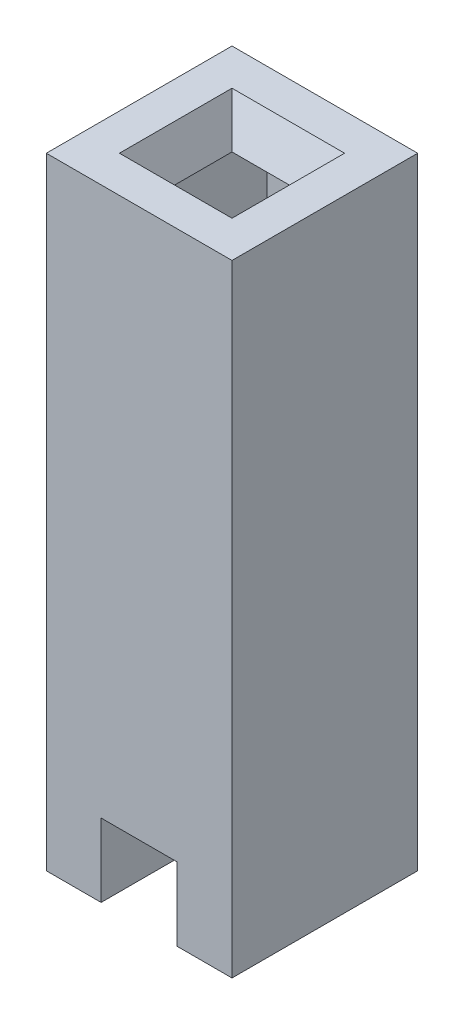
ISO-10303-21;
HEADER;
FILE_DESCRIPTION(('STEP AP214'),'2;1');
FILE_NAME('part.step','',(''),(''),'','','');
FILE_SCHEMA(('AUTOMOTIVE_DESIGN { 1 0 10303 214 1 1 1 1 }'));
ENDSEC;
DATA;
#1=APPLICATION_CONTEXT('core data for automotive mechanical design processes');
#2=APPLICATION_PROTOCOL_DEFINITION('international standard','automotive_design',2000,#1);
#3=PRODUCT_CONTEXT('',#1,'mechanical');
#4=PRODUCT('Part','Part','',(#3));
#5=PRODUCT_RELATED_PRODUCT_CATEGORY('part','',(#4));
#6=PRODUCT_DEFINITION_FORMATION('','',#4);
#7=PRODUCT_DEFINITION_CONTEXT('part definition',#1,'design');
#8=PRODUCT_DEFINITION('design','',#6,#7);
#9=PRODUCT_DEFINITION_SHAPE('','',#8);
#10=(LENGTH_UNIT() NAMED_UNIT(*) SI_UNIT(.MILLI.,.METRE.));
#11=(NAMED_UNIT(*) PLANE_ANGLE_UNIT() SI_UNIT($,.RADIAN.));
#12=(NAMED_UNIT(*) SI_UNIT($,.STERADIAN.) SOLID_ANGLE_UNIT());
#13=UNCERTAINTY_MEASURE_WITH_UNIT(LENGTH_MEASURE(1.E-05),#10,'distance_accuracy_value','');
#14=(GEOMETRIC_REPRESENTATION_CONTEXT(3) GLOBAL_UNCERTAINTY_ASSIGNED_CONTEXT((#13)) GLOBAL_UNIT_ASSIGNED_CONTEXT((#10,
#11,#12)) REPRESENTATION_CONTEXT('',''));
#15=CARTESIAN_POINT('',(0.,0.,0.));
#16=DIRECTION('',(0.,0.,1.));
#17=DIRECTION('',(1.,0.,0.));
#18=AXIS2_PLACEMENT_3D('',#15,#16,#17);
#19=CARTESIAN_POINT('',(-0.75,1.,2.54));
#20=DIRECTION('',(0.,1.,0.));
#21=DIRECTION('',(-1.,0.,0.));
#22=AXIS2_PLACEMENT_3D('',#19,#20,#21);
#23=PLANE('',#22);
#24=DIRECTION('',(0.,0.,-1.));
#25=VECTOR('',#24,1.);
#26=CARTESIAN_POINT('',(-1.79,1.,2.54));
#27=LINE('',#26,#25);
#28=CARTESIAN_POINT('',(-1.79,1.,2.54));
#29=VERTEX_POINT('',#28);
#30=CARTESIAN_POINT('',(-1.79,1.,2.27));
#31=VERTEX_POINT('',#30);
#32=EDGE_CURVE('E275',#29,#31,#27,.T.);
#33=ORIENTED_EDGE('',*,*,#32,.T.);
#34=DIRECTION('',(-1.,0.,0.));
#35=VECTOR('',#34,1.);
#36=CARTESIAN_POINT('',(-1.79,1.,2.27));
#37=LINE('',#36,#35);
#38=CARTESIAN_POINT('',(-0.75,1.,2.27));
#39=VERTEX_POINT('',#38);
#40=EDGE_CURVE('E211',#39,#31,#37,.T.);
#41=ORIENTED_EDGE('',*,*,#40,.F.);
#42=DIRECTION('',(0.,0.,-1.));
#43=VECTOR('',#42,1.);
#44=CARTESIAN_POINT('',(-0.75,1.,2.54));
#45=LINE('',#44,#43);
#46=CARTESIAN_POINT('',(-0.75,1.,2.54));
#47=VERTEX_POINT('',#46);
#48=EDGE_CURVE('E271',#47,#39,#45,.T.);
#49=ORIENTED_EDGE('',*,*,#48,.F.);
#50=DIRECTION('',(1.,0.,0.));
#51=VECTOR('',#50,1.);
#52=CARTESIAN_POINT('',(-0.75,1.,2.54));
#53=LINE('',#52,#51);
#54=EDGE_CURVE('E240',#29,#47,#53,.T.);
#55=ORIENTED_EDGE('',*,*,#54,.F.);
#56=EDGE_LOOP('',(#33,#41,#49,#55));
#57=FACE_BOUND('',#56,.T.);
#58=ADVANCED_FACE('F40',(#57),#23,.F.);
#59=CARTESIAN_POINT('',(0.,0.,2.54));
#60=DIRECTION('',(-1.,0.,0.));
#61=DIRECTION('',(0.,-1.,0.));
#62=AXIS2_PLACEMENT_3D('',#59,#60,#61);
#63=PLANE('',#62);
#64=DIRECTION('',(0.,1.,0.));
#65=VECTOR('',#64,1.);
#66=CARTESIAN_POINT('',(0.,0.,0.));
#67=LINE('',#66,#65);
#68=CARTESIAN_POINT('',(0.,0.,0.));
#69=VERTEX_POINT('',#68);
#70=CARTESIAN_POINT('',(0.,8.5,0.));
#71=VERTEX_POINT('',#70);
#72=EDGE_CURVE('E226',#69,#71,#67,.T.);
#73=ORIENTED_EDGE('',*,*,#72,.T.);
#74=DIRECTION('',(0.,0.,-1.));
#75=VECTOR('',#74,1.);
#76=CARTESIAN_POINT('',(0.,8.5,2.54));
#77=LINE('',#76,#75);
#78=CARTESIAN_POINT('',(0.,8.5,2.54));
#79=VERTEX_POINT('',#78);
#80=EDGE_CURVE('E12',#79,#71,#77,.T.);
#81=ORIENTED_EDGE('',*,*,#80,.F.);
#82=DIRECTION('',(0.,1.,0.));
#83=VECTOR('',#82,1.);
#84=CARTESIAN_POINT('',(0.,0.,2.54));
#85=LINE('',#84,#83);
#86=CARTESIAN_POINT('',(0.,0.,2.54));
#87=VERTEX_POINT('',#86);
#88=EDGE_CURVE('E227',#87,#79,#85,.T.);
#89=ORIENTED_EDGE('',*,*,#88,.F.);
#90=DIRECTION('',(0.,0.,-1.));
#91=VECTOR('',#90,1.);
#92=CARTESIAN_POINT('',(0.,0.,2.54));
#93=LINE('',#92,#91);
#94=EDGE_CURVE('E246',#87,#69,#93,.T.);
#95=ORIENTED_EDGE('',*,*,#94,.T.);
#96=EDGE_LOOP('',(#73,#81,#89,#95));
#97=FACE_BOUND('',#96,.T.);
#98=ADVANCED_FACE('F42',(#97),#63,.F.);
#99=CARTESIAN_POINT('',(0.,8.5,2.54));
#100=DIRECTION('',(0.,-1.,0.));
#101=DIRECTION('',(0.,0.,-1.));
#102=AXIS2_PLACEMENT_3D('',#99,#100,#101);
#103=PLANE('',#102);
#104=DIRECTION('',(-1.,0.,0.));
#105=VECTOR('',#104,1.);
#106=CARTESIAN_POINT('',(-0.5,8.5,0.5));
#107=LINE('',#106,#105);
#108=CARTESIAN_POINT('',(-0.5,8.5,0.5));
#109=VERTEX_POINT('',#108);
#110=CARTESIAN_POINT('',(-2.04,8.5,0.5));
#111=VERTEX_POINT('',#110);
#112=EDGE_CURVE('E180',#109,#111,#107,.T.);
#113=ORIENTED_EDGE('',*,*,#112,.F.);
#114=DIRECTION('',(0.,0.,-1.));
#115=VECTOR('',#114,1.);
#116=CARTESIAN_POINT('',(-0.5,8.5,2.04));
#117=LINE('',#116,#115);
#118=CARTESIAN_POINT('',(-0.5,8.5,2.04));
#119=VERTEX_POINT('',#118);
#120=EDGE_CURVE('E55',#119,#109,#117,.T.);
#121=ORIENTED_EDGE('',*,*,#120,.F.);
#122=DIRECTION('',(1.,0.,0.));
#123=VECTOR('',#122,1.);
#124=CARTESIAN_POINT('',(-2.04,8.5,2.04));
#125=LINE('',#124,#123);
#126=CARTESIAN_POINT('',(-2.04,8.5,2.04));
#127=VERTEX_POINT('',#126);
#128=EDGE_CURVE('E166',#127,#119,#125,.T.);
#129=ORIENTED_EDGE('',*,*,#128,.F.);
#130=DIRECTION('',(0.,0.,1.));
#131=VECTOR('',#130,1.);
#132=CARTESIAN_POINT('',(-2.04,8.5,0.5));
#133=LINE('',#132,#131);
#134=EDGE_CURVE('E175',#111,#127,#133,.T.);
#135=ORIENTED_EDGE('',*,*,#134,.F.);
#136=EDGE_LOOP('',(#113,#121,#129,#135));
#137=FACE_BOUND('',#136,.T.);
#138=DIRECTION('',(-1.,0.,0.));
#139=VECTOR('',#138,1.);
#140=CARTESIAN_POINT('',(0.,8.5,0.));
#141=LINE('',#140,#139);
#142=CARTESIAN_POINT('',(-2.54,8.5,0.));
#143=VERTEX_POINT('',#142);
#144=EDGE_CURVE('E250',#71,#143,#141,.T.);
#145=ORIENTED_EDGE('',*,*,#144,.T.);
#146=DIRECTION('',(0.,0.,-1.));
#147=VECTOR('',#146,1.);
#148=CARTESIAN_POINT('',(-2.54,8.5,2.54));
#149=LINE('',#148,#147);
#150=CARTESIAN_POINT('',(-2.54,8.5,2.54));
#151=VERTEX_POINT('',#150);
#152=EDGE_CURVE('E48',#151,#143,#149,.T.);
#153=ORIENTED_EDGE('',*,*,#152,.F.);
#154=DIRECTION('',(-1.,0.,0.));
#155=VECTOR('',#154,1.);
#156=CARTESIAN_POINT('',(0.,8.5,2.54));
#157=LINE('',#156,#155);
#158=EDGE_CURVE('E231',#79,#151,#157,.T.);
#159=ORIENTED_EDGE('',*,*,#158,.F.);
#160=ORIENTED_EDGE('',*,*,#80,.T.);
#161=EDGE_LOOP('',(#145,#153,#159,#160));
#162=FACE_BOUND('',#161,.T.);
#163=ADVANCED_FACE('F178',(#137,#162),#103,.F.);
#164=CARTESIAN_POINT('',(-2.54,0.,2.54));
#165=DIRECTION('',(1.,0.,0.));
#166=DIRECTION('',(0.,0.,-1.));
#167=AXIS2_PLACEMENT_3D('',#164,#165,#166);
#168=PLANE('',#167);
#169=DIRECTION('',(0.,-1.,0.));
#170=VECTOR('',#169,1.);
#171=CARTESIAN_POINT('',(-2.54,0.,0.));
#172=LINE('',#171,#170);
#173=CARTESIAN_POINT('',(-2.54,0.,0.));
#174=VERTEX_POINT('',#173);
#175=EDGE_CURVE('E252',#143,#174,#172,.T.);
#176=ORIENTED_EDGE('',*,*,#175,.T.);
#177=DIRECTION('',(0.,0.,-1.));
#178=VECTOR('',#177,1.);
#179=CARTESIAN_POINT('',(-2.54,0.,2.54));
#180=LINE('',#179,#178);
#181=CARTESIAN_POINT('',(-2.54,0.,2.54));
#182=VERTEX_POINT('',#181);
#183=EDGE_CURVE('E281',#182,#174,#180,.T.);
#184=ORIENTED_EDGE('',*,*,#183,.F.);
#185=DIRECTION('',(0.,-1.,0.));
#186=VECTOR('',#185,1.);
#187=CARTESIAN_POINT('',(-2.54,0.,2.54));
#188=LINE('',#187,#186);
#189=EDGE_CURVE('E234',#151,#182,#188,.T.);
#190=ORIENTED_EDGE('',*,*,#189,.F.);
#191=ORIENTED_EDGE('',*,*,#152,.T.);
#192=EDGE_LOOP('',(#176,#184,#190,#191));
#193=FACE_BOUND('',#192,.T.);
#194=ADVANCED_FACE('F290',(#193),#168,.F.);
#195=CARTESIAN_POINT('',(-1.79,0.,2.54));
#196=DIRECTION('',(0.,1.,0.));
#197=DIRECTION('',(-1.,0.,0.));
#198=AXIS2_PLACEMENT_3D('',#195,#196,#197);
#199=PLANE('',#198);
#200=DIRECTION('',(1.,0.,0.));
#201=VECTOR('',#200,1.);
#202=CARTESIAN_POINT('',(-1.79,0.,0.));
#203=LINE('',#202,#201);
#204=CARTESIAN_POINT('',(-1.79,0.,0.));
#205=VERTEX_POINT('',#204);
#206=EDGE_CURVE('E254',#174,#205,#203,.T.);
#207=ORIENTED_EDGE('',*,*,#206,.T.);
#208=DIRECTION('',(0.,0.,-1.));
#209=VECTOR('',#208,1.);
#210=CARTESIAN_POINT('',(-1.79,0.,2.54));
#211=LINE('',#210,#209);
#212=CARTESIAN_POINT('',(-1.79,0.,2.54));
#213=VERTEX_POINT('',#212);
#214=EDGE_CURVE('E278',#213,#205,#211,.T.);
#215=ORIENTED_EDGE('',*,*,#214,.F.);
#216=DIRECTION('',(1.,0.,0.));
#217=VECTOR('',#216,1.);
#218=CARTESIAN_POINT('',(-1.79,0.,2.54));
#219=LINE('',#218,#217);
#220=EDGE_CURVE('E236',#182,#213,#219,.T.);
#221=ORIENTED_EDGE('',*,*,#220,.F.);
#222=ORIENTED_EDGE('',*,*,#183,.T.);
#223=EDGE_LOOP('',(#207,#215,#221,#222));
#224=FACE_BOUND('',#223,.T.);
#225=ADVANCED_FACE('F300',(#224),#199,.F.);
#226=CARTESIAN_POINT('',(-1.79,0.,2.54));
#227=DIRECTION('',(-1.,0.,0.));
#228=DIRECTION('',(0.,0.,1.));
#229=AXIS2_PLACEMENT_3D('',#226,#227,#228);
#230=PLANE('',#229);
#231=DIRECTION('',(0.,1.,0.));
#232=VECTOR('',#231,1.);
#233=CARTESIAN_POINT('',(-1.79,0.,0.));
#234=LINE('',#233,#232);
#235=CARTESIAN_POINT('',(-1.79,1.,0.));
#236=VERTEX_POINT('',#235);
#237=EDGE_CURVE('E256',#205,#236,#234,.T.);
#238=ORIENTED_EDGE('',*,*,#237,.T.);
#239=CARTESIAN_POINT('',(-1.79,1.,0.27));
#240=VERTEX_POINT('',#239);
#241=EDGE_CURVE('E274',#240,#236,#27,.T.);
#242=ORIENTED_EDGE('',*,*,#241,.F.);
#243=DIRECTION('',(0.,-1.,0.));
#244=VECTOR('',#243,1.);
#245=CARTESIAN_POINT('',(-1.79,10.7542404485769,0.27));
#246=LINE('',#245,#244);
#247=CARTESIAN_POINT('',(-1.79,8.,0.27));
#248=VERTEX_POINT('',#247);
#249=EDGE_CURVE('E214',#248,#240,#246,.T.);
#250=ORIENTED_EDGE('',*,*,#249,.F.);
#251=DIRECTION('',(0.,0.,1.));
#252=VECTOR('',#251,1.);
#253=CARTESIAN_POINT('',(-1.79,8.,2.27));
#254=LINE('',#253,#252);
#255=CARTESIAN_POINT('',(-1.79,8.,2.27));
#256=VERTEX_POINT('',#255);
#257=EDGE_CURVE('E206',#248,#256,#254,.T.);
#258=ORIENTED_EDGE('',*,*,#257,.T.);
#259=DIRECTION('',(0.,-1.,0.));
#260=VECTOR('',#259,1.);
#261=CARTESIAN_POINT('',(-1.79,10.7542404485769,2.27));
#262=LINE('',#261,#260);
#263=EDGE_CURVE('E204',#256,#31,#262,.T.);
#264=ORIENTED_EDGE('',*,*,#263,.T.);
#265=ORIENTED_EDGE('',*,*,#32,.F.);
#266=DIRECTION('',(0.,1.,0.));
#267=VECTOR('',#266,1.);
#268=CARTESIAN_POINT('',(-1.79,0.,2.54));
#269=LINE('',#268,#267);
#270=EDGE_CURVE('E238',#213,#29,#269,.T.);
#271=ORIENTED_EDGE('',*,*,#270,.F.);
#272=ORIENTED_EDGE('',*,*,#214,.T.);
#273=EDGE_LOOP('',(#238,#242,#250,#258,#264,#265,#271,#272));
#274=FACE_BOUND('',#273,.T.);
#275=ADVANCED_FACE('F304',(#274),#230,.F.);
#276=CARTESIAN_POINT('',(-0.75,1.,0.27));
#277=VERTEX_POINT('',#276);
#278=CARTESIAN_POINT('',(-0.75,1.,0.));
#279=VERTEX_POINT('',#278);
#280=EDGE_CURVE('E270',#277,#279,#45,.T.);
#281=ORIENTED_EDGE('',*,*,#280,.F.);
#282=DIRECTION('',(1.,0.,0.));
#283=VECTOR('',#282,1.);
#284=CARTESIAN_POINT('',(-1.79,1.,0.27));
#285=LINE('',#284,#283);
#286=EDGE_CURVE('E174',#240,#277,#285,.T.);
#287=ORIENTED_EDGE('',*,*,#286,.F.);
#288=ORIENTED_EDGE('',*,*,#241,.T.);
#289=DIRECTION('',(1.,0.,0.));
#290=VECTOR('',#289,1.);
#291=CARTESIAN_POINT('',(-0.75,1.,0.));
#292=LINE('',#291,#290);
#293=EDGE_CURVE('E259',#236,#279,#292,.T.);
#294=ORIENTED_EDGE('',*,*,#293,.T.);
#295=EDGE_LOOP('',(#281,#287,#288,#294));
#296=FACE_BOUND('',#295,.T.);
#297=ADVANCED_FACE('F328',(#296),#23,.F.);
#298=CARTESIAN_POINT('',(-0.75,0.,2.54));
#299=DIRECTION('',(1.,0.,0.));
#300=DIRECTION('',(0.,0.,-1.));
#301=AXIS2_PLACEMENT_3D('',#298,#299,#300);
#302=PLANE('',#301);
#303=DIRECTION('',(0.,-1.,0.));
#304=VECTOR('',#303,1.);
#305=CARTESIAN_POINT('',(-0.75,0.,0.));
#306=LINE('',#305,#304);
#307=CARTESIAN_POINT('',(-0.75,0.,0.));
#308=VERTEX_POINT('',#307);
#309=EDGE_CURVE('E262',#279,#308,#306,.T.);
#310=ORIENTED_EDGE('',*,*,#309,.T.);
#311=DIRECTION('',(0.,0.,-1.));
#312=VECTOR('',#311,1.);
#313=CARTESIAN_POINT('',(-0.75,0.,2.54));
#314=LINE('',#313,#312);
#315=CARTESIAN_POINT('',(-0.75,0.,2.54));
#316=VERTEX_POINT('',#315);
#317=EDGE_CURVE('E267',#316,#308,#314,.T.);
#318=ORIENTED_EDGE('',*,*,#317,.F.);
#319=DIRECTION('',(0.,-1.,0.));
#320=VECTOR('',#319,1.);
#321=CARTESIAN_POINT('',(-0.75,0.,2.54));
#322=LINE('',#321,#320);
#323=EDGE_CURVE('E242',#47,#316,#322,.T.);
#324=ORIENTED_EDGE('',*,*,#323,.F.);
#325=ORIENTED_EDGE('',*,*,#48,.T.);
#326=DIRECTION('',(0.,-1.,0.));
#327=VECTOR('',#326,1.);
#328=CARTESIAN_POINT('',(-0.750000000000002,10.7542404485769,2.27));
#329=LINE('',#328,#327);
#330=CARTESIAN_POINT('',(-0.750000000000002,8.,2.27));
#331=VERTEX_POINT('',#330);
#332=EDGE_CURVE('E216',#331,#39,#329,.T.);
#333=ORIENTED_EDGE('',*,*,#332,.F.);
#334=DIRECTION('',(0.,0.,-1.));
#335=VECTOR('',#334,1.);
#336=CARTESIAN_POINT('',(-0.750000000000002,8.,2.27));
#337=LINE('',#336,#335);
#338=CARTESIAN_POINT('',(-0.750000000000002,8.,0.27));
#339=VERTEX_POINT('',#338);
#340=EDGE_CURVE('E201',#331,#339,#337,.T.);
#341=ORIENTED_EDGE('',*,*,#340,.T.);
#342=DIRECTION('',(0.,-1.,0.));
#343=VECTOR('',#342,1.);
#344=CARTESIAN_POINT('',(-0.750000000000002,10.7542404485769,0.27));
#345=LINE('',#344,#343);
#346=EDGE_CURVE('E219',#339,#277,#345,.T.);
#347=ORIENTED_EDGE('',*,*,#346,.T.);
#348=ORIENTED_EDGE('',*,*,#280,.T.);
#349=EDGE_LOOP('',(#310,#318,#324,#325,#333,#341,#347,#348));
#350=FACE_BOUND('',#349,.T.);
#351=ADVANCED_FACE('F323',(#350),#302,.F.);
#352=CARTESIAN_POINT('',(0.,0.,2.54));
#353=DIRECTION('',(0.,1.,0.));
#354=DIRECTION('',(-1.,0.,0.));
#355=AXIS2_PLACEMENT_3D('',#352,#353,#354);
#356=PLANE('',#355);
#357=DIRECTION('',(1.,0.,0.));
#358=VECTOR('',#357,1.);
#359=CARTESIAN_POINT('',(0.,0.,0.));
#360=LINE('',#359,#358);
#361=EDGE_CURVE('E232',#308,#69,#360,.T.);
#362=ORIENTED_EDGE('',*,*,#361,.T.);
#363=ORIENTED_EDGE('',*,*,#94,.F.);
#364=DIRECTION('',(1.,0.,0.));
#365=VECTOR('',#364,1.);
#366=CARTESIAN_POINT('',(0.,0.,2.54));
#367=LINE('',#366,#365);
#368=EDGE_CURVE('E244',#316,#87,#367,.T.);
#369=ORIENTED_EDGE('',*,*,#368,.F.);
#370=ORIENTED_EDGE('',*,*,#317,.T.);
#371=EDGE_LOOP('',(#362,#363,#369,#370));
#372=FACE_BOUND('',#371,.T.);
#373=ADVANCED_FACE('F318',(#372),#356,.F.);
#374=CARTESIAN_POINT('',(0.,0.,2.54));
#375=DIRECTION('',(0.,0.,1.));
#376=DIRECTION('',(1.,0.,0.));
#377=AXIS2_PLACEMENT_3D('',#374,#375,#376);
#378=PLANE('',#377);
#379=ORIENTED_EDGE('',*,*,#88,.T.);
#380=ORIENTED_EDGE('',*,*,#158,.T.);
#381=ORIENTED_EDGE('',*,*,#189,.T.);
#382=ORIENTED_EDGE('',*,*,#220,.T.);
#383=ORIENTED_EDGE('',*,*,#270,.T.);
#384=ORIENTED_EDGE('',*,*,#54,.T.);
#385=ORIENTED_EDGE('',*,*,#323,.T.);
#386=ORIENTED_EDGE('',*,*,#368,.T.);
#387=EDGE_LOOP('',(#379,#380,#381,#382,#383,#384,#385,#386));
#388=FACE_BOUND('',#387,.T.);
#389=ADVANCED_FACE('F309',(#388),#378,.T.);
#390=CARTESIAN_POINT('',(0.,0.,0.));
#391=DIRECTION('',(0.,0.,1.));
#392=DIRECTION('',(1.,0.,0.));
#393=AXIS2_PLACEMENT_3D('',#390,#391,#392);
#394=PLANE('',#393);
#395=ORIENTED_EDGE('',*,*,#72,.F.);
#396=ORIENTED_EDGE('',*,*,#361,.F.);
#397=ORIENTED_EDGE('',*,*,#309,.F.);
#398=ORIENTED_EDGE('',*,*,#293,.F.);
#399=ORIENTED_EDGE('',*,*,#237,.F.);
#400=ORIENTED_EDGE('',*,*,#206,.F.);
#401=ORIENTED_EDGE('',*,*,#175,.F.);
#402=ORIENTED_EDGE('',*,*,#144,.F.);
#403=EDGE_LOOP('',(#395,#396,#397,#398,#399,#400,#401,#402));
#404=FACE_BOUND('',#403,.T.);
#405=ADVANCED_FACE('F295',(#404),#394,.F.);
#406=CARTESIAN_POINT('',(-1.79,10.7542404485769,2.27));
#407=DIRECTION('',(0.,0.,1.));
#408=DIRECTION('',(1.,0.,0.));
#409=AXIS2_PLACEMENT_3D('',#406,#407,#408);
#410=PLANE('',#409);
#411=DIRECTION('',(1.,0.,0.));
#412=VECTOR('',#411,1.);
#413=CARTESIAN_POINT('',(-1.79,8.,2.27));
#414=LINE('',#413,#412);
#415=EDGE_CURVE('E203',#256,#331,#414,.T.);
#416=ORIENTED_EDGE('',*,*,#415,.T.);
#417=ORIENTED_EDGE('',*,*,#332,.T.);
#418=ORIENTED_EDGE('',*,*,#40,.T.);
#419=ORIENTED_EDGE('',*,*,#263,.F.);
#420=EDGE_LOOP('',(#416,#417,#418,#419));
#421=FACE_BOUND('',#420,.T.);
#422=ADVANCED_FACE('F341',(#421),#410,.F.);
#423=CARTESIAN_POINT('',(-1.79,10.7542404485769,0.27));
#424=DIRECTION('',(0.,0.,-1.));
#425=DIRECTION('',(-1.,0.,0.));
#426=AXIS2_PLACEMENT_3D('',#423,#424,#425);
#427=PLANE('',#426);
#428=DIRECTION('',(-1.,0.,0.));
#429=VECTOR('',#428,1.);
#430=CARTESIAN_POINT('',(-1.79,8.,0.27));
#431=LINE('',#430,#429);
#432=EDGE_CURVE('E209',#339,#248,#431,.T.);
#433=ORIENTED_EDGE('',*,*,#432,.T.);
#434=ORIENTED_EDGE('',*,*,#249,.T.);
#435=ORIENTED_EDGE('',*,*,#286,.T.);
#436=ORIENTED_EDGE('',*,*,#346,.F.);
#437=EDGE_LOOP('',(#433,#434,#435,#436));
#438=FACE_BOUND('',#437,.T.);
#439=ADVANCED_FACE('F333',(#438),#427,.F.);
#440=CARTESIAN_POINT('',(0.,8.,2.54));
#441=DIRECTION('',(0.,-1.,0.));
#442=DIRECTION('',(0.,0.,-1.));
#443=AXIS2_PLACEMENT_3D('',#440,#441,#442);
#444=PLANE('',#443);
#445=DIRECTION('',(0.,0.,-1.));
#446=VECTOR('',#445,1.);
#447=CARTESIAN_POINT('',(-0.754762724747216,8.,2.04));
#448=LINE('',#447,#446);
#449=CARTESIAN_POINT('',(-0.754762724747216,8.,1.78523727525278));
#450=VERTEX_POINT('',#449);
#451=CARTESIAN_POINT('',(-0.754762724747216,8.,0.754762724747215));
#452=VERTEX_POINT('',#451);
#453=EDGE_CURVE('E159',#450,#452,#448,.T.);
#454=ORIENTED_EDGE('',*,*,#453,.T.);
#455=DIRECTION('',(-1.,0.,0.));
#456=VECTOR('',#455,1.);
#457=CARTESIAN_POINT('',(-0.5,8.,0.754762724747215));
#458=LINE('',#457,#456);
#459=CARTESIAN_POINT('',(-1.78523727525278,8.,0.754762724747215));
#460=VERTEX_POINT('',#459);
#461=EDGE_CURVE('E184',#452,#460,#458,.T.);
#462=ORIENTED_EDGE('',*,*,#461,.T.);
#463=DIRECTION('',(0.,0.,1.));
#464=VECTOR('',#463,1.);
#465=CARTESIAN_POINT('',(-1.78523727525279,8.,0.5));
#466=LINE('',#465,#464);
#467=CARTESIAN_POINT('',(-1.78523727525279,8.,1.78523727525278));
#468=VERTEX_POINT('',#467);
#469=EDGE_CURVE('E162',#460,#468,#466,.T.);
#470=ORIENTED_EDGE('',*,*,#469,.T.);
#471=DIRECTION('',(1.,0.,0.));
#472=VECTOR('',#471,1.);
#473=CARTESIAN_POINT('',(-2.04,8.,1.78523727525278));
#474=LINE('',#473,#472);
#475=EDGE_CURVE('E163',#468,#450,#474,.T.);
#476=ORIENTED_EDGE('',*,*,#475,.T.);
#477=EDGE_LOOP('',(#454,#462,#470,#476));
#478=FACE_BOUND('',#477,.T.);
#479=ORIENTED_EDGE('',*,*,#257,.F.);
#480=ORIENTED_EDGE('',*,*,#432,.F.);
#481=ORIENTED_EDGE('',*,*,#340,.F.);
#482=ORIENTED_EDGE('',*,*,#415,.F.);
#483=EDGE_LOOP('',(#479,#480,#481,#482));
#484=FACE_BOUND('',#483,.T.);
#485=ADVANCED_FACE('F337',(#478,#484),#444,.T.);
#486=CARTESIAN_POINT('',(-0.5,8.5,2.04));
#487=DIRECTION('',(0.891006524188367,-0.453990499739548,0.));
#488=DIRECTION('',(0.453990499739548,0.891006524188367,0.));
#489=AXIS2_PLACEMENT_3D('',#486,#487,#488);
#490=PLANE('',#489);
#491=DIRECTION('',(0.413384109704205,0.811311996514364,0.413384109704205));
#492=VECTOR('',#491,1.);
#493=CARTESIAN_POINT('',(-0.763165090120145,7.983509429448,1.77683490987986));
#494=LINE('',#493,#492);
#495=EDGE_CURVE('E155',#450,#119,#494,.T.);
#496=ORIENTED_EDGE('',*,*,#495,.T.);
#497=ORIENTED_EDGE('',*,*,#120,.T.);
#498=DIRECTION('',(0.413384109704205,0.811311996514364,-0.413384109704205));
#499=VECTOR('',#498,1.);
#500=CARTESIAN_POINT('',(-0.763165090120145,7.983509429448,0.763165090120145));
#501=LINE('',#500,#499);
#502=EDGE_CURVE('E192',#452,#109,#501,.T.);
#503=ORIENTED_EDGE('',*,*,#502,.F.);
#504=ORIENTED_EDGE('',*,*,#453,.F.);
#505=EDGE_LOOP('',(#496,#497,#503,#504));
#506=FACE_BOUND('',#505,.T.);
#507=ADVANCED_FACE('F157',(#506),#490,.F.);
#508=CARTESIAN_POINT('',(-2.04,8.5,2.04));
#509=DIRECTION('',(0.,-0.453990499739548,0.891006524188367));
#510=DIRECTION('',(0.,-0.891006524188367,-0.453990499739548));
#511=AXIS2_PLACEMENT_3D('',#508,#509,#510);
#512=PLANE('',#511);
#513=DIRECTION('',(-0.413384109704205,0.811311996514364,0.413384109704205));
#514=VECTOR('',#513,1.);
#515=CARTESIAN_POINT('',(-1.77683490987986,7.983509429448,1.77683490987986));
#516=LINE('',#515,#514);
#517=EDGE_CURVE('E169',#468,#127,#516,.T.);
#518=ORIENTED_EDGE('',*,*,#517,.T.);
#519=ORIENTED_EDGE('',*,*,#128,.T.);
#520=ORIENTED_EDGE('',*,*,#495,.F.);
#521=ORIENTED_EDGE('',*,*,#475,.F.);
#522=EDGE_LOOP('',(#518,#519,#520,#521));
#523=FACE_BOUND('',#522,.T.);
#524=ADVANCED_FACE('F167',(#523),#512,.F.);
#525=CARTESIAN_POINT('',(-2.04,8.5,0.5));
#526=DIRECTION('',(-0.891006524188367,-0.453990499739548,0.));
#527=DIRECTION('',(0.453990499739548,-0.891006524188367,0.));
#528=AXIS2_PLACEMENT_3D('',#525,#526,#527);
#529=PLANE('',#528);
#530=DIRECTION('',(-0.413384109704205,0.811311996514364,-0.413384109704205));
#531=VECTOR('',#530,1.);
#532=CARTESIAN_POINT('',(-1.77683490987986,7.983509429448,0.763165090120145));
#533=LINE('',#532,#531);
#534=EDGE_CURVE('E65',#460,#111,#533,.T.);
#535=ORIENTED_EDGE('',*,*,#534,.T.);
#536=ORIENTED_EDGE('',*,*,#134,.T.);
#537=ORIENTED_EDGE('',*,*,#517,.F.);
#538=ORIENTED_EDGE('',*,*,#469,.F.);
#539=EDGE_LOOP('',(#535,#536,#537,#538));
#540=FACE_BOUND('',#539,.T.);
#541=ADVANCED_FACE('F467',(#540),#529,.F.);
#542=CARTESIAN_POINT('',(-0.5,8.5,0.5));
#543=DIRECTION('',(0.,-0.453990499739548,-0.891006524188367));
#544=DIRECTION('',(0.,0.891006524188367,-0.453990499739548));
#545=AXIS2_PLACEMENT_3D('',#542,#543,#544);
#546=PLANE('',#545);
#547=ORIENTED_EDGE('',*,*,#502,.T.);
#548=ORIENTED_EDGE('',*,*,#112,.T.);
#549=ORIENTED_EDGE('',*,*,#534,.F.);
#550=ORIENTED_EDGE('',*,*,#461,.F.);
#551=EDGE_LOOP('',(#547,#548,#549,#550));
#552=FACE_BOUND('',#551,.T.);
#553=ADVANCED_FACE('F476',(#552),#546,.F.);
#554=CLOSED_SHELL('',(#58,#98,#163,#194,#225,#275,#297,#351,#373,#389,#405,#422,#439,#485,#507,
#524,#541,#553));
#555=MANIFOLD_SOLID_BREP('B2',#554);
#556=ADVANCED_BREP_SHAPE_REPRESENTATION('',(#18,#555),#14);
#557=SHAPE_DEFINITION_REPRESENTATION(#9,#556);
ENDSEC;
END-ISO-10303-21;
